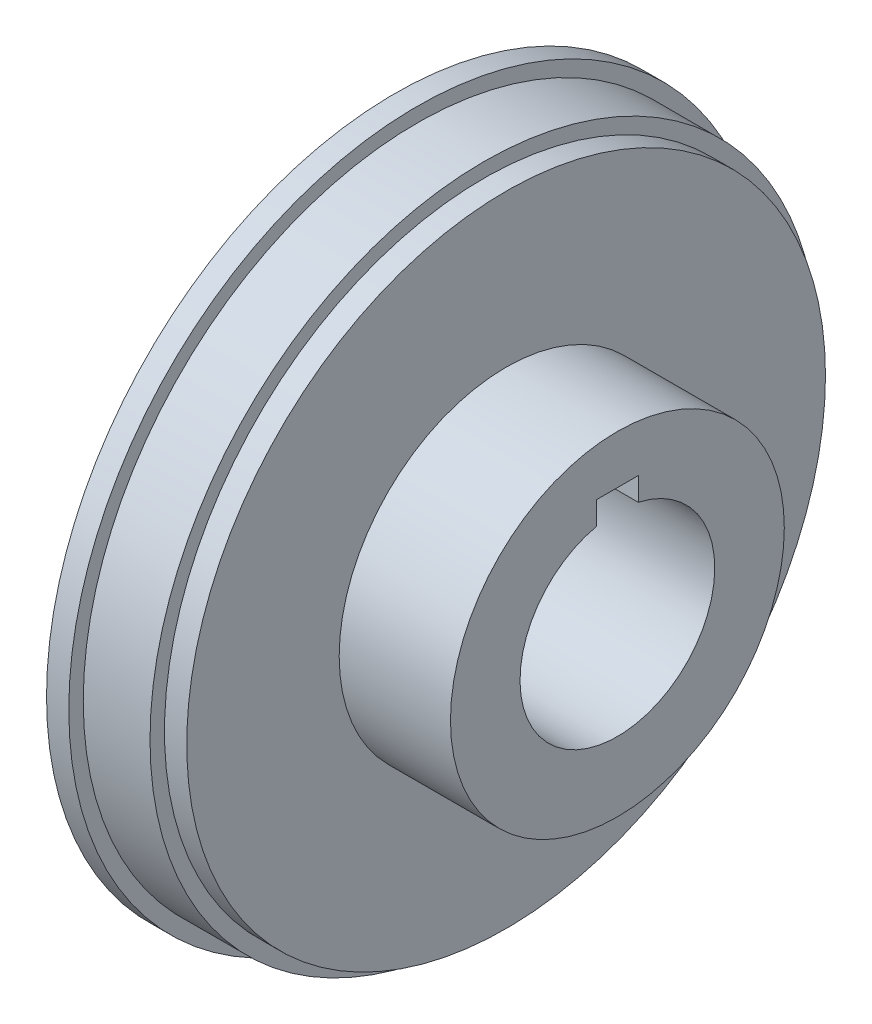
ISO-10303-21;
HEADER;
FILE_DESCRIPTION(('STEP AP214'),'2;1');
FILE_NAME('part.step','',(''),(''),'','','');
FILE_SCHEMA(('AUTOMOTIVE_DESIGN { 1 0 10303 214 1 1 1 1 }'));
ENDSEC;
DATA;
#1=APPLICATION_CONTEXT('core data for automotive mechanical design processes');
#2=APPLICATION_PROTOCOL_DEFINITION('international standard','automotive_design',2000,#1);
#3=PRODUCT_CONTEXT('',#1,'mechanical');
#4=PRODUCT('Part','Part','',(#3));
#5=PRODUCT_RELATED_PRODUCT_CATEGORY('part','',(#4));
#6=PRODUCT_DEFINITION_FORMATION('','',#4);
#7=PRODUCT_DEFINITION_CONTEXT('part definition',#1,'design');
#8=PRODUCT_DEFINITION('design','',#6,#7);
#9=PRODUCT_DEFINITION_SHAPE('','',#8);
#10=(LENGTH_UNIT() NAMED_UNIT(*) SI_UNIT(.MILLI.,.METRE.));
#11=(NAMED_UNIT(*) PLANE_ANGLE_UNIT() SI_UNIT($,.RADIAN.));
#12=(NAMED_UNIT(*) SI_UNIT($,.STERADIAN.) SOLID_ANGLE_UNIT());
#13=UNCERTAINTY_MEASURE_WITH_UNIT(LENGTH_MEASURE(1.E-05),#10,'distance_accuracy_value','');
#14=(GEOMETRIC_REPRESENTATION_CONTEXT(3) GLOBAL_UNCERTAINTY_ASSIGNED_CONTEXT((#13)) GLOBAL_UNIT_ASSIGNED_CONTEXT((#10,
#11,#12)) REPRESENTATION_CONTEXT('',''));
#15=CARTESIAN_POINT('',(0.,0.,0.));
#16=DIRECTION('',(0.,0.,1.));
#17=DIRECTION('',(1.,0.,0.));
#18=AXIS2_PLACEMENT_3D('',#15,#16,#17);
#19=CARTESIAN_POINT('',(12.7,0.,0.));
#20=DIRECTION('',(-1.,0.,0.));
#21=DIRECTION('',(0.,0.,1.));
#22=AXIS2_PLACEMENT_3D('',#19,#20,#21);
#23=CYLINDRICAL_SURFACE('',#22,38.1);
#24=CARTESIAN_POINT('',(2.54,0.,0.));
#25=DIRECTION('',(-1.,0.,0.));
#26=DIRECTION('',(0.,0.,1.));
#27=AXIS2_PLACEMENT_3D('',#24,#25,#26);
#28=CIRCLE('',#27,38.1);
#29=CARTESIAN_POINT('',(2.54,0.,38.1));
#30=VERTEX_POINT('',#29);
#31=EDGE_CURVE('E254',#30,#30,#28,.T.);
#32=ORIENTED_EDGE('',*,*,#31,.F.);
#33=EDGE_LOOP('',(#32));
#34=FACE_BOUND('',#33,.T.);
#35=CARTESIAN_POINT('',(10.16,0.,0.));
#36=DIRECTION('',(1.,0.,0.));
#37=DIRECTION('',(0.,0.,-1.));
#38=AXIS2_PLACEMENT_3D('',#35,#36,#37);
#39=CIRCLE('',#38,38.1);
#40=CARTESIAN_POINT('',(10.16,0.,-38.1));
#41=VERTEX_POINT('',#40);
#42=EDGE_CURVE('E249',#41,#41,#39,.T.);
#43=ORIENTED_EDGE('',*,*,#42,.F.);
#44=EDGE_LOOP('',(#43));
#45=FACE_BOUND('',#44,.T.);
#46=ADVANCED_FACE('F34',(#34,#45),#23,.T.);
#47=CARTESIAN_POINT('',(12.7,0.,0.));
#48=DIRECTION('',(-1.,0.,0.));
#49=DIRECTION('',(0.,0.,1.));
#50=AXIS2_PLACEMENT_3D('',#47,#48,#49);
#51=PLANE('',#50);
#52=CARTESIAN_POINT('',(12.7,0.,0.));
#53=DIRECTION('',(-1.,0.,0.));
#54=DIRECTION('',(0.,0.,1.));
#55=AXIS2_PLACEMENT_3D('',#52,#53,#54);
#56=CIRCLE('',#55,19.05);
#57=CARTESIAN_POINT('',(12.7,0.,19.05));
#58=VERTEX_POINT('',#57);
#59=EDGE_CURVE('E103',#58,#58,#56,.F.);
#60=ORIENTED_EDGE('',*,*,#59,.F.);
#61=EDGE_LOOP('',(#60));
#62=FACE_BOUND('',#61,.T.);
#63=CARTESIAN_POINT('',(12.7,0.,0.));
#64=DIRECTION('',(1.,0.,0.));
#65=DIRECTION('',(0.,0.,-1.));
#66=AXIS2_PLACEMENT_3D('',#63,#64,#65);
#67=CIRCLE('',#66,36.449);
#68=CARTESIAN_POINT('',(12.7,0.,-36.449));
#69=VERTEX_POINT('',#68);
#70=EDGE_CURVE('E246',#69,#69,#67,.T.);
#71=ORIENTED_EDGE('',*,*,#70,.T.);
#72=EDGE_LOOP('',(#71));
#73=FACE_BOUND('',#72,.T.);
#74=ADVANCED_FACE('F119',(#62,#73),#51,.F.);
#75=CARTESIAN_POINT('',(25.4,0.,0.));
#76=DIRECTION('',(1.,0.,0.));
#77=DIRECTION('',(0.,0.,-1.));
#78=AXIS2_PLACEMENT_3D('',#75,#76,#77);
#79=PLANE('',#78);
#80=CARTESIAN_POINT('',(25.4,0.,0.));
#81=DIRECTION('',(1.,0.,0.));
#82=DIRECTION('',(0.,0.,-1.));
#83=AXIS2_PLACEMENT_3D('',#80,#81,#82);
#84=CIRCLE('',#83,11.1125);
#85=CARTESIAN_POINT('',(25.4,10.854368000372,2.38125));
#86=VERTEX_POINT('',#85);
#87=CARTESIAN_POINT('',(25.4,10.854368000372,-2.38125));
#88=VERTEX_POINT('',#87);
#89=EDGE_CURVE('E93',#86,#88,#84,.T.);
#90=ORIENTED_EDGE('',*,*,#89,.F.);
#91=DIRECTION('',(0.,-1.,0.));
#92=VECTOR('',#91,1.);
#93=CARTESIAN_POINT('',(25.4,0.,2.38125));
#94=LINE('',#93,#92);
#95=CARTESIAN_POINT('',(25.4,13.49375,2.38125));
#96=VERTEX_POINT('',#95);
#97=EDGE_CURVE('E84',#96,#86,#94,.T.);
#98=ORIENTED_EDGE('',*,*,#97,.F.);
#99=DIRECTION('',(0.,0.,-1.));
#100=VECTOR('',#99,1.);
#101=CARTESIAN_POINT('',(25.4,13.49375,0.));
#102=LINE('',#101,#100);
#103=CARTESIAN_POINT('',(25.4,13.49375,-2.38125));
#104=VERTEX_POINT('',#103);
#105=EDGE_CURVE('E88',#96,#104,#102,.T.);
#106=ORIENTED_EDGE('',*,*,#105,.T.);
#107=DIRECTION('',(0.,-1.,0.));
#108=VECTOR('',#107,1.);
#109=CARTESIAN_POINT('',(25.4,0.,-2.38125));
#110=LINE('',#109,#108);
#111=EDGE_CURVE('E51',#104,#88,#110,.T.);
#112=ORIENTED_EDGE('',*,*,#111,.T.);
#113=EDGE_LOOP('',(#90,#98,#106,#112));
#114=FACE_BOUND('',#113,.T.);
#115=CARTESIAN_POINT('',(25.4,0.,0.));
#116=DIRECTION('',(1.,0.,0.));
#117=DIRECTION('',(0.,0.,-1.));
#118=AXIS2_PLACEMENT_3D('',#115,#116,#117);
#119=CIRCLE('',#118,19.05);
#120=CARTESIAN_POINT('',(25.4,0.,-19.05));
#121=VERTEX_POINT('',#120);
#122=EDGE_CURVE('E261',#121,#121,#119,.T.);
#123=ORIENTED_EDGE('',*,*,#122,.T.);
#124=EDGE_LOOP('',(#123));
#125=FACE_BOUND('',#124,.T.);
#126=ADVANCED_FACE('F91',(#114,#125),#79,.T.);
#127=CARTESIAN_POINT('',(25.4,0.,0.));
#128=DIRECTION('',(-1.,0.,0.));
#129=DIRECTION('',(0.,0.,1.));
#130=AXIS2_PLACEMENT_3D('',#127,#128,#129);
#131=CYLINDRICAL_SURFACE('',#130,11.1125);
#132=CARTESIAN_POINT('',(0.,0.,0.));
#133=DIRECTION('',(1.,0.,0.));
#134=DIRECTION('',(0.,0.,-1.));
#135=AXIS2_PLACEMENT_3D('',#132,#133,#134);
#136=CIRCLE('',#135,11.1125);
#137=CARTESIAN_POINT('',(0.,10.854368000372,2.38125));
#138=VERTEX_POINT('',#137);
#139=CARTESIAN_POINT('',(0.,10.854368000372,-2.38125));
#140=VERTEX_POINT('',#139);
#141=EDGE_CURVE('E100',#138,#140,#136,.T.);
#142=ORIENTED_EDGE('',*,*,#141,.F.);
#143=DIRECTION('',(-1.,0.,0.));
#144=VECTOR('',#143,1.);
#145=CARTESIAN_POINT('',(25.4,10.854368000372,2.38125));
#146=LINE('',#145,#144);
#147=EDGE_CURVE('E11',#86,#138,#146,.T.);
#148=ORIENTED_EDGE('',*,*,#147,.F.);
#149=ORIENTED_EDGE('',*,*,#89,.T.);
#150=DIRECTION('',(-1.,0.,0.));
#151=VECTOR('',#150,1.);
#152=CARTESIAN_POINT('',(25.4,10.854368000372,-2.38125));
#153=LINE('',#152,#151);
#154=EDGE_CURVE('E73',#88,#140,#153,.T.);
#155=ORIENTED_EDGE('',*,*,#154,.T.);
#156=EDGE_LOOP('',(#142,#148,#149,#155));
#157=FACE_BOUND('',#156,.T.);
#158=ADVANCED_FACE('F36',(#157),#131,.F.);
#159=CARTESIAN_POINT('',(25.4,0.,2.38125));
#160=DIRECTION('',(0.,0.,-1.));
#161=DIRECTION('',(0.,1.,0.));
#162=AXIS2_PLACEMENT_3D('',#159,#160,#161);
#163=PLANE('',#162);
#164=DIRECTION('',(0.,-1.,0.));
#165=VECTOR('',#164,1.);
#166=CARTESIAN_POINT('',(0.,0.,2.38125));
#167=LINE('',#166,#165);
#168=CARTESIAN_POINT('',(0.,13.49375,2.38125));
#169=VERTEX_POINT('',#168);
#170=EDGE_CURVE('E86',#169,#138,#167,.T.);
#171=ORIENTED_EDGE('',*,*,#170,.F.);
#172=DIRECTION('',(-1.,0.,0.));
#173=VECTOR('',#172,1.);
#174=CARTESIAN_POINT('',(25.4,13.49375,2.38125));
#175=LINE('',#174,#173);
#176=EDGE_CURVE('E43',#96,#169,#175,.T.);
#177=ORIENTED_EDGE('',*,*,#176,.F.);
#178=ORIENTED_EDGE('',*,*,#97,.T.);
#179=ORIENTED_EDGE('',*,*,#147,.T.);
#180=EDGE_LOOP('',(#171,#177,#178,#179));
#181=FACE_BOUND('',#180,.T.);
#182=ADVANCED_FACE('F82',(#181),#163,.T.);
#183=CARTESIAN_POINT('',(25.4,13.49375,0.));
#184=DIRECTION('',(0.,1.,0.));
#185=DIRECTION('',(0.,0.,1.));
#186=AXIS2_PLACEMENT_3D('',#183,#184,#185);
#187=PLANE('',#186);
#188=DIRECTION('',(0.,0.,-1.));
#189=VECTOR('',#188,1.);
#190=CARTESIAN_POINT('',(0.,13.49375,0.));
#191=LINE('',#190,#189);
#192=CARTESIAN_POINT('',(0.,13.49375,-2.38125));
#193=VERTEX_POINT('',#192);
#194=EDGE_CURVE('E66',#169,#193,#191,.T.);
#195=ORIENTED_EDGE('',*,*,#194,.T.);
#196=DIRECTION('',(-1.,0.,0.));
#197=VECTOR('',#196,1.);
#198=CARTESIAN_POINT('',(25.4,13.49375,-2.38125));
#199=LINE('',#198,#197);
#200=EDGE_CURVE('E87',#104,#193,#199,.T.);
#201=ORIENTED_EDGE('',*,*,#200,.F.);
#202=ORIENTED_EDGE('',*,*,#105,.F.);
#203=ORIENTED_EDGE('',*,*,#176,.T.);
#204=EDGE_LOOP('',(#195,#201,#202,#203));
#205=FACE_BOUND('',#204,.T.);
#206=ADVANCED_FACE('F89',(#205),#187,.F.);
#207=CARTESIAN_POINT('',(25.4,0.,-2.38125));
#208=DIRECTION('',(0.,0.,-1.));
#209=DIRECTION('',(0.,1.,0.));
#210=AXIS2_PLACEMENT_3D('',#207,#208,#209);
#211=PLANE('',#210);
#212=DIRECTION('',(0.,-1.,0.));
#213=VECTOR('',#212,1.);
#214=CARTESIAN_POINT('',(0.,0.,-2.38125));
#215=LINE('',#214,#213);
#216=EDGE_CURVE('E95',#193,#140,#215,.T.);
#217=ORIENTED_EDGE('',*,*,#216,.T.);
#218=ORIENTED_EDGE('',*,*,#154,.F.);
#219=ORIENTED_EDGE('',*,*,#111,.F.);
#220=ORIENTED_EDGE('',*,*,#200,.T.);
#221=EDGE_LOOP('',(#217,#218,#219,#220));
#222=FACE_BOUND('',#221,.T.);
#223=ADVANCED_FACE('F110',(#222),#211,.F.);
#224=CARTESIAN_POINT('',(0.,0.,0.));
#225=DIRECTION('',(1.,0.,0.));
#226=DIRECTION('',(0.,0.,-1.));
#227=AXIS2_PLACEMENT_3D('',#224,#225,#226);
#228=PLANE('',#227);
#229=ORIENTED_EDGE('',*,*,#141,.T.);
#230=ORIENTED_EDGE('',*,*,#216,.F.);
#231=ORIENTED_EDGE('',*,*,#194,.F.);
#232=ORIENTED_EDGE('',*,*,#170,.T.);
#233=EDGE_LOOP('',(#229,#230,#231,#232));
#234=FACE_BOUND('',#233,.T.);
#235=CARTESIAN_POINT('',(0.,0.,0.));
#236=DIRECTION('',(-1.,0.,0.));
#237=DIRECTION('',(0.,0.,1.));
#238=AXIS2_PLACEMENT_3D('',#235,#236,#237);
#239=CIRCLE('',#238,39.751);
#240=CARTESIAN_POINT('',(0.,0.,39.751));
#241=VERTEX_POINT('',#240);
#242=EDGE_CURVE('E257',#241,#241,#239,.T.);
#243=ORIENTED_EDGE('',*,*,#242,.T.);
#244=EDGE_LOOP('',(#243));
#245=FACE_BOUND('',#244,.T.);
#246=ADVANCED_FACE('F112',(#234,#245),#228,.F.);
#247=CARTESIAN_POINT('',(-59.1420489685532,0.,0.));
#248=DIRECTION('',(1.,0.,0.));
#249=DIRECTION('',(0.,0.,-1.));
#250=AXIS2_PLACEMENT_3D('',#247,#248,#249);
#251=CYLINDRICAL_SURFACE('',#250,19.05);
#252=ORIENTED_EDGE('',*,*,#122,.F.);
#253=EDGE_LOOP('',(#252));
#254=FACE_BOUND('',#253,.T.);
#255=ORIENTED_EDGE('',*,*,#59,.T.);
#256=EDGE_LOOP('',(#255));
#257=FACE_BOUND('',#256,.T.);
#258=ADVANCED_FACE('F135',(#254,#257),#251,.T.);
#259=CARTESIAN_POINT('',(2.54,0.,0.));
#260=DIRECTION('',(-1.,0.,0.));
#261=DIRECTION('',(0.,0.,1.));
#262=AXIS2_PLACEMENT_3D('',#259,#260,#261);
#263=CYLINDRICAL_SURFACE('',#262,39.751);
#264=CARTESIAN_POINT('',(2.54,0.,0.));
#265=DIRECTION('',(-1.,0.,0.));
#266=DIRECTION('',(0.,0.,1.));
#267=AXIS2_PLACEMENT_3D('',#264,#265,#266);
#268=CIRCLE('',#267,39.751);
#269=CARTESIAN_POINT('',(2.54,0.,39.751));
#270=VERTEX_POINT('',#269);
#271=EDGE_CURVE('E258',#270,#270,#268,.T.);
#272=ORIENTED_EDGE('',*,*,#271,.T.);
#273=EDGE_LOOP('',(#272));
#274=FACE_BOUND('',#273,.T.);
#275=ORIENTED_EDGE('',*,*,#242,.F.);
#276=EDGE_LOOP('',(#275));
#277=FACE_BOUND('',#276,.T.);
#278=ADVANCED_FACE('F159',(#274,#277),#263,.T.);
#279=CARTESIAN_POINT('',(2.54,0.,0.));
#280=DIRECTION('',(-1.,0.,0.));
#281=DIRECTION('',(0.,0.,1.));
#282=AXIS2_PLACEMENT_3D('',#279,#280,#281);
#283=PLANE('',#282);
#284=ORIENTED_EDGE('',*,*,#31,.T.);
#285=EDGE_LOOP('',(#284));
#286=FACE_BOUND('',#285,.T.);
#287=ORIENTED_EDGE('',*,*,#271,.F.);
#288=EDGE_LOOP('',(#287));
#289=FACE_BOUND('',#288,.T.);
#290=ADVANCED_FACE('F165',(#286,#289),#283,.F.);
#291=CARTESIAN_POINT('',(10.16,0.,0.));
#292=DIRECTION('',(1.,0.,0.));
#293=DIRECTION('',(0.,0.,-1.));
#294=AXIS2_PLACEMENT_3D('',#291,#292,#293);
#295=PLANE('',#294);
#296=CARTESIAN_POINT('',(10.16,0.,0.));
#297=DIRECTION('',(1.,0.,0.));
#298=DIRECTION('',(0.,0.,-1.));
#299=AXIS2_PLACEMENT_3D('',#296,#297,#298);
#300=CIRCLE('',#299,36.449);
#301=CARTESIAN_POINT('',(10.16,0.,-36.449));
#302=VERTEX_POINT('',#301);
#303=EDGE_CURVE('E243',#302,#302,#300,.T.);
#304=ORIENTED_EDGE('',*,*,#303,.F.);
#305=EDGE_LOOP('',(#304));
#306=FACE_BOUND('',#305,.T.);
#307=ORIENTED_EDGE('',*,*,#42,.T.);
#308=EDGE_LOOP('',(#307));
#309=FACE_BOUND('',#308,.T.);
#310=ADVANCED_FACE('F173',(#306,#309),#295,.T.);
#311=CARTESIAN_POINT('',(10.16,0.,0.));
#312=DIRECTION('',(1.,0.,0.));
#313=DIRECTION('',(0.,0.,-1.));
#314=AXIS2_PLACEMENT_3D('',#311,#312,#313);
#315=CYLINDRICAL_SURFACE('',#314,36.449);
#316=ORIENTED_EDGE('',*,*,#303,.T.);
#317=EDGE_LOOP('',(#316));
#318=FACE_BOUND('',#317,.T.);
#319=ORIENTED_EDGE('',*,*,#70,.F.);
#320=EDGE_LOOP('',(#319));
#321=FACE_BOUND('',#320,.T.);
#322=ADVANCED_FACE('F181',(#318,#321),#315,.T.);
#323=CLOSED_SHELL('',(#46,#74,#126,#158,#182,#206,#223,#246,#258,#278,#290,#310,#322));
#324=MANIFOLD_SOLID_BREP('B2',#323);
#325=ADVANCED_BREP_SHAPE_REPRESENTATION('',(#18,#324),#14);
#326=SHAPE_DEFINITION_REPRESENTATION(#9,#325);
ENDSEC;
END-ISO-10303-21;
